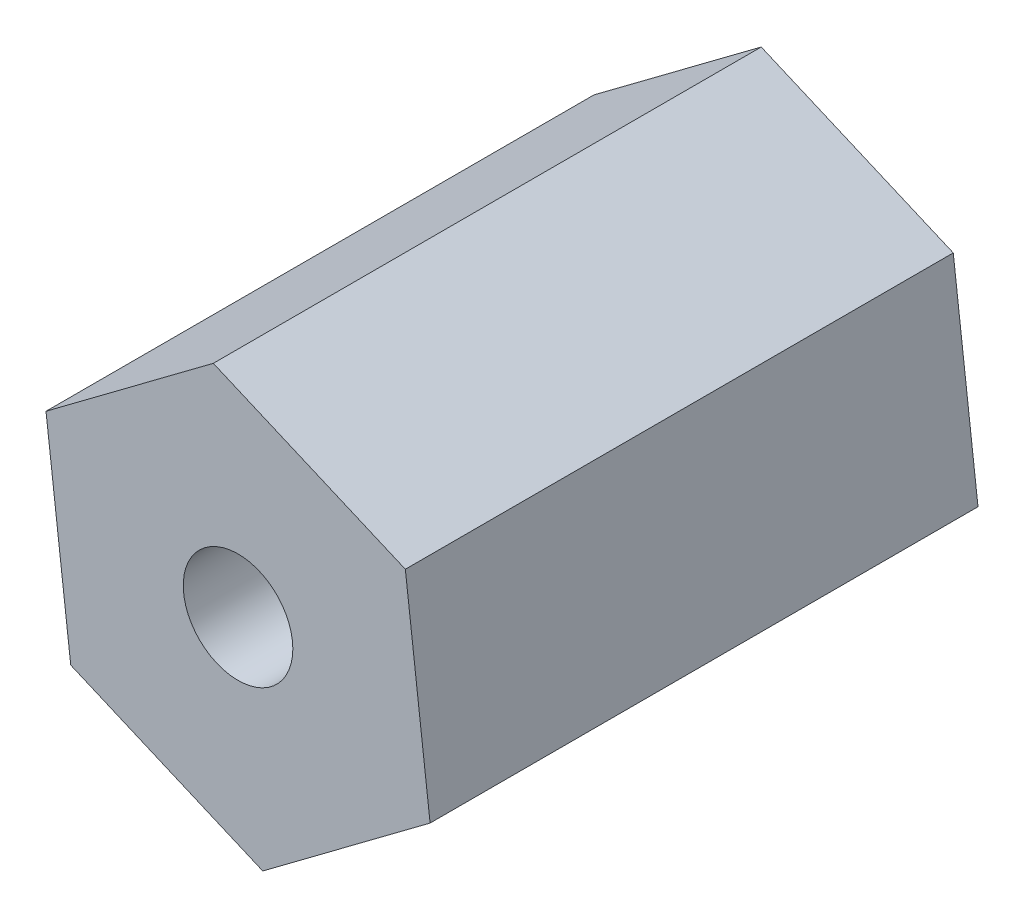
ISO-10303-21;
HEADER;
FILE_DESCRIPTION(('STEP AP214'),'2;1');
FILE_NAME('part.step','',(''),(''),'','','');
FILE_SCHEMA(('AUTOMOTIVE_DESIGN { 1 0 10303 214 1 1 1 1 }'));
ENDSEC;
DATA;
#1=APPLICATION_CONTEXT('core data for automotive mechanical design processes');
#2=APPLICATION_PROTOCOL_DEFINITION('international standard','automotive_design',2000,#1);
#3=PRODUCT_CONTEXT('',#1,'mechanical');
#4=PRODUCT('Part','Part','',(#3));
#5=PRODUCT_RELATED_PRODUCT_CATEGORY('part','',(#4));
#6=PRODUCT_DEFINITION_FORMATION('','',#4);
#7=PRODUCT_DEFINITION_CONTEXT('part definition',#1,'design');
#8=PRODUCT_DEFINITION('design','',#6,#7);
#9=PRODUCT_DEFINITION_SHAPE('','',#8);
#10=(LENGTH_UNIT() NAMED_UNIT(*) SI_UNIT(.MILLI.,.METRE.));
#11=(NAMED_UNIT(*) PLANE_ANGLE_UNIT() SI_UNIT($,.RADIAN.));
#12=(NAMED_UNIT(*) SI_UNIT($,.STERADIAN.) SOLID_ANGLE_UNIT());
#13=UNCERTAINTY_MEASURE_WITH_UNIT(LENGTH_MEASURE(1.E-05),#10,'distance_accuracy_value','');
#14=(GEOMETRIC_REPRESENTATION_CONTEXT(3) GLOBAL_UNCERTAINTY_ASSIGNED_CONTEXT((#13)) GLOBAL_UNIT_ASSIGNED_CONTEXT((#10,
#11,#12)) REPRESENTATION_CONTEXT('',''));
#15=CARTESIAN_POINT('',(0.,0.,0.));
#16=DIRECTION('',(0.,0.,1.));
#17=DIRECTION('',(1.,0.,0.));
#18=AXIS2_PLACEMENT_3D('',#15,#16,#17);
#19=CARTESIAN_POINT('',(-76.3813969155034,4.71352086722475,9.525));
#20=DIRECTION('',(0.,0.,1.));
#21=DIRECTION('',(1.,0.,0.));
#22=AXIS2_PLACEMENT_3D('',#19,#20,#21);
#23=PLANE('',#22);
#24=DIRECTION('',(0.800716634619522,0.599043296468283,0.));
#25=VECTOR('',#24,1.);
#26=CARTESIAN_POINT('',(-79.2897598757684,2.53767580579264,9.525));
#27=LINE('',#26,#25);
#28=CARTESIAN_POINT('',(-79.2897598757684,2.53767580579264,9.525));
#29=VERTEX_POINT('',#28);
#30=CARTESIAN_POINT('',(-76.3813969155034,4.71352086722476,9.525));
#31=VERTEX_POINT('',#30);
#32=EDGE_CURVE('E130',#29,#31,#27,.T.);
#33=ORIENTED_EDGE('',*,*,#32,.T.);
#34=DIRECTION('',(-0.118428395398548,0.99296259504743,0.));
#35=VECTOR('',#34,1.);
#36=CARTESIAN_POINT('',(-76.3813969155034,4.71352086722476,9.525));
#37=LINE('',#36,#35);
#38=CARTESIAN_POINT('',(-76.81155253327,8.32015960495602,9.525));
#39=VERTEX_POINT('',#38);
#40=EDGE_CURVE('E88',#31,#39,#37,.T.);
#41=ORIENTED_EDGE('',*,*,#40,.T.);
#42=DIRECTION('',(-0.919145030018068,0.393919298579144,0.));
#43=VECTOR('',#42,1.);
#44=CARTESIAN_POINT('',(-76.81155253327,8.32015960495602,9.525));
#45=LINE('',#44,#43);
#46=CARTESIAN_POINT('',(-80.1500711113016,9.75095328125519,9.525));
#47=VERTEX_POINT('',#46);
#48=EDGE_CURVE('E101',#39,#47,#45,.T.);
#49=ORIENTED_EDGE('',*,*,#48,.T.);
#50=DIRECTION('',(-0.80071663461952,-0.599043296468285,0.));
#51=VECTOR('',#50,1.);
#52=CARTESIAN_POINT('',(-80.1500711113016,9.75095328125519,9.525));
#53=LINE('',#52,#51);
#54=CARTESIAN_POINT('',(-83.0584340715666,7.57510821982309,9.525));
#55=VERTEX_POINT('',#54);
#56=EDGE_CURVE('E95',#47,#55,#53,.T.);
#57=ORIENTED_EDGE('',*,*,#56,.T.);
#58=DIRECTION('',(0.118428395398547,-0.992962595047429,0.));
#59=VECTOR('',#58,1.);
#60=CARTESIAN_POINT('',(-83.0584340715666,7.57510821982309,9.525));
#61=LINE('',#60,#59);
#62=CARTESIAN_POINT('',(-82.6282784538,3.96846948209181,9.525));
#63=VERTEX_POINT('',#62);
#64=EDGE_CURVE('E99',#55,#63,#61,.T.);
#65=ORIENTED_EDGE('',*,*,#64,.T.);
#66=DIRECTION('',(0.919145030018067,-0.393919298579145,0.));
#67=VECTOR('',#66,1.);
#68=CARTESIAN_POINT('',(-82.6282784538,3.96846948209181,9.525));
#69=LINE('',#68,#67);
#70=EDGE_CURVE('E51',#63,#29,#69,.T.);
#71=ORIENTED_EDGE('',*,*,#70,.T.);
#72=EDGE_LOOP('',(#33,#41,#49,#57,#65,#71));
#73=FACE_BOUND('',#72,.T.);
#74=CARTESIAN_POINT('',(-79.719915493535,6.14431454352392,9.525));
#75=DIRECTION('',(0.,0.,1.));
#76=DIRECTION('',(1.,0.,0.));
#77=AXIS2_PLACEMENT_3D('',#74,#75,#76);
#78=CIRCLE('',#77,0.952499999999996);
#79=CARTESIAN_POINT('',(-78.767415493535,6.14431454352392,9.525));
#80=VERTEX_POINT('',#79);
#81=EDGE_CURVE('E123',#80,#80,#78,.T.);
#82=ORIENTED_EDGE('',*,*,#81,.F.);
#83=EDGE_LOOP('',(#82));
#84=FACE_BOUND('',#83,.T.);
#85=ADVANCED_FACE('F34',(#73,#84),#23,.T.);
#86=CARTESIAN_POINT('',(-76.3813969155034,4.71352086722475,0.));
#87=DIRECTION('',(0.,0.,1.));
#88=DIRECTION('',(1.,0.,0.));
#89=AXIS2_PLACEMENT_3D('',#86,#87,#88);
#90=PLANE('',#89);
#91=DIRECTION('',(0.800716634619522,0.599043296468283,0.));
#92=VECTOR('',#91,1.);
#93=CARTESIAN_POINT('',(-79.2897598757684,2.53767580579264,0.));
#94=LINE('',#93,#92);
#95=CARTESIAN_POINT('',(-79.2897598757684,2.53767580579264,0.));
#96=VERTEX_POINT('',#95);
#97=CARTESIAN_POINT('',(-76.3813969155034,4.71352086722476,0.));
#98=VERTEX_POINT('',#97);
#99=EDGE_CURVE('E119',#96,#98,#94,.T.);
#100=ORIENTED_EDGE('',*,*,#99,.F.);
#101=DIRECTION('',(0.919145030018067,-0.393919298579145,0.));
#102=VECTOR('',#101,1.);
#103=CARTESIAN_POINT('',(-82.6282784538,3.96846948209181,0.));
#104=LINE('',#103,#102);
#105=CARTESIAN_POINT('',(-82.6282784538,3.96846948209181,0.));
#106=VERTEX_POINT('',#105);
#107=EDGE_CURVE('E80',#106,#96,#104,.T.);
#108=ORIENTED_EDGE('',*,*,#107,.F.);
#109=DIRECTION('',(0.118428395398547,-0.992962595047429,0.));
#110=VECTOR('',#109,1.);
#111=CARTESIAN_POINT('',(-83.0584340715666,7.57510821982309,0.));
#112=LINE('',#111,#110);
#113=CARTESIAN_POINT('',(-83.0584340715666,7.57510821982309,0.));
#114=VERTEX_POINT('',#113);
#115=EDGE_CURVE('E74',#114,#106,#112,.T.);
#116=ORIENTED_EDGE('',*,*,#115,.F.);
#117=DIRECTION('',(-0.80071663461952,-0.599043296468285,0.));
#118=VECTOR('',#117,1.);
#119=CARTESIAN_POINT('',(-80.1500711113016,9.75095328125519,0.));
#120=LINE('',#119,#118);
#121=CARTESIAN_POINT('',(-80.1500711113016,9.75095328125519,0.));
#122=VERTEX_POINT('',#121);
#123=EDGE_CURVE('E109',#122,#114,#120,.T.);
#124=ORIENTED_EDGE('',*,*,#123,.F.);
#125=DIRECTION('',(-0.919145030018068,0.393919298579144,0.));
#126=VECTOR('',#125,1.);
#127=CARTESIAN_POINT('',(-76.81155253327,8.32015960495602,0.));
#128=LINE('',#127,#126);
#129=CARTESIAN_POINT('',(-76.81155253327,8.32015960495602,0.));
#130=VERTEX_POINT('',#129);
#131=EDGE_CURVE('E125',#130,#122,#128,.T.);
#132=ORIENTED_EDGE('',*,*,#131,.F.);
#133=DIRECTION('',(-0.118428395398548,0.99296259504743,0.));
#134=VECTOR('',#133,1.);
#135=CARTESIAN_POINT('',(-76.3813969155034,4.71352086722476,0.));
#136=LINE('',#135,#134);
#137=EDGE_CURVE('E122',#98,#130,#136,.T.);
#138=ORIENTED_EDGE('',*,*,#137,.F.);
#139=EDGE_LOOP('',(#100,#108,#116,#124,#132,#138));
#140=FACE_BOUND('',#139,.T.);
#141=CARTESIAN_POINT('',(-79.719915493535,6.14431454352392,0.));
#142=DIRECTION('',(0.,0.,1.));
#143=DIRECTION('',(1.,0.,0.));
#144=AXIS2_PLACEMENT_3D('',#141,#142,#143);
#145=CIRCLE('',#144,0.952499999999996);
#146=CARTESIAN_POINT('',(-78.767415493535,6.14431454352392,0.));
#147=VERTEX_POINT('',#146);
#148=EDGE_CURVE('E223',#147,#147,#145,.T.);
#149=ORIENTED_EDGE('',*,*,#148,.T.);
#150=EDGE_LOOP('',(#149));
#151=FACE_BOUND('',#150,.T.);
#152=ADVANCED_FACE('F139',(#140,#151),#90,.F.);
#153=CARTESIAN_POINT('',(-79.2897598757684,2.53767580579264,9.525));
#154=DIRECTION('',(-0.599043296468283,0.800716634619522,0.));
#155=DIRECTION('',(-0.800716634619522,-0.599043296468283,0.));
#156=AXIS2_PLACEMENT_3D('',#153,#154,#155);
#157=PLANE('',#156);
#158=ORIENTED_EDGE('',*,*,#99,.T.);
#159=DIRECTION('',(0.,0.,-1.));
#160=VECTOR('',#159,1.);
#161=CARTESIAN_POINT('',(-76.3813969155034,4.71352086722476,9.525));
#162=LINE('',#161,#160);
#163=EDGE_CURVE('E11',#31,#98,#162,.T.);
#164=ORIENTED_EDGE('',*,*,#163,.F.);
#165=ORIENTED_EDGE('',*,*,#32,.F.);
#166=DIRECTION('',(0.,0.,-1.));
#167=VECTOR('',#166,1.);
#168=CARTESIAN_POINT('',(-79.2897598757684,2.53767580579264,9.525));
#169=LINE('',#168,#167);
#170=EDGE_CURVE('E115',#29,#96,#169,.T.);
#171=ORIENTED_EDGE('',*,*,#170,.T.);
#172=EDGE_LOOP('',(#158,#164,#165,#171));
#173=FACE_BOUND('',#172,.T.);
#174=ADVANCED_FACE('F36',(#173),#157,.F.);
#175=CARTESIAN_POINT('',(-76.3813969155034,4.71352086722476,9.525));
#176=DIRECTION('',(-0.992962595047429,-0.118428395398548,0.));
#177=DIRECTION('',(0.118428395398548,-0.992962595047429,0.));
#178=AXIS2_PLACEMENT_3D('',#175,#176,#177);
#179=PLANE('',#178);
#180=ORIENTED_EDGE('',*,*,#137,.T.);
#181=DIRECTION('',(0.,0.,-1.));
#182=VECTOR('',#181,1.);
#183=CARTESIAN_POINT('',(-76.81155253327,8.32015960495602,9.525));
#184=LINE('',#183,#182);
#185=EDGE_CURVE('E43',#39,#130,#184,.T.);
#186=ORIENTED_EDGE('',*,*,#185,.F.);
#187=ORIENTED_EDGE('',*,*,#40,.F.);
#188=ORIENTED_EDGE('',*,*,#163,.T.);
#189=EDGE_LOOP('',(#180,#186,#187,#188));
#190=FACE_BOUND('',#189,.T.);
#191=ADVANCED_FACE('F164',(#190),#179,.F.);
#192=CARTESIAN_POINT('',(-76.81155253327,8.32015960495602,9.525));
#193=DIRECTION('',(-0.393919298579144,-0.919145030018068,0.));
#194=DIRECTION('',(0.919145030018068,-0.393919298579144,0.));
#195=AXIS2_PLACEMENT_3D('',#192,#193,#194);
#196=PLANE('',#195);
#197=ORIENTED_EDGE('',*,*,#131,.T.);
#198=DIRECTION('',(0.,0.,-1.));
#199=VECTOR('',#198,1.);
#200=CARTESIAN_POINT('',(-80.1500711113016,9.75095328125519,9.525));
#201=LINE('',#200,#199);
#202=EDGE_CURVE('E110',#47,#122,#201,.T.);
#203=ORIENTED_EDGE('',*,*,#202,.F.);
#204=ORIENTED_EDGE('',*,*,#48,.F.);
#205=ORIENTED_EDGE('',*,*,#185,.T.);
#206=EDGE_LOOP('',(#197,#203,#204,#205));
#207=FACE_BOUND('',#206,.T.);
#208=ADVANCED_FACE('F136',(#207),#196,.F.);
#209=CARTESIAN_POINT('',(-80.1500711113016,9.75095328125519,9.525));
#210=DIRECTION('',(0.599043296468285,-0.80071663461952,0.));
#211=DIRECTION('',(0.80071663461952,0.599043296468285,0.));
#212=AXIS2_PLACEMENT_3D('',#209,#210,#211);
#213=PLANE('',#212);
#214=ORIENTED_EDGE('',*,*,#123,.T.);
#215=DIRECTION('',(0.,0.,-1.));
#216=VECTOR('',#215,1.);
#217=CARTESIAN_POINT('',(-83.0584340715666,7.57510821982309,9.525));
#218=LINE('',#217,#216);
#219=EDGE_CURVE('E106',#55,#114,#218,.T.);
#220=ORIENTED_EDGE('',*,*,#219,.F.);
#221=ORIENTED_EDGE('',*,*,#56,.F.);
#222=ORIENTED_EDGE('',*,*,#202,.T.);
#223=EDGE_LOOP('',(#214,#220,#221,#222));
#224=FACE_BOUND('',#223,.T.);
#225=ADVANCED_FACE('F107',(#224),#213,.F.);
#226=CARTESIAN_POINT('',(-83.0584340715666,7.57510821982309,9.525));
#227=DIRECTION('',(0.99296259504743,0.118428395398547,0.));
#228=DIRECTION('',(-0.118428395398547,0.992962595047429,0.));
#229=AXIS2_PLACEMENT_3D('',#226,#227,#228);
#230=PLANE('',#229);
#231=ORIENTED_EDGE('',*,*,#115,.T.);
#232=DIRECTION('',(0.,0.,-1.));
#233=VECTOR('',#232,1.);
#234=CARTESIAN_POINT('',(-82.6282784538,3.96846948209181,9.525));
#235=LINE('',#234,#233);
#236=EDGE_CURVE('E111',#63,#106,#235,.T.);
#237=ORIENTED_EDGE('',*,*,#236,.F.);
#238=ORIENTED_EDGE('',*,*,#64,.F.);
#239=ORIENTED_EDGE('',*,*,#219,.T.);
#240=EDGE_LOOP('',(#231,#237,#238,#239));
#241=FACE_BOUND('',#240,.T.);
#242=ADVANCED_FACE('F113',(#241),#230,.F.);
#243=CARTESIAN_POINT('',(-82.6282784538,3.96846948209181,9.525));
#244=DIRECTION('',(0.393919298579145,0.919145030018067,0.));
#245=DIRECTION('',(-0.919145030018068,0.393919298579145,0.));
#246=AXIS2_PLACEMENT_3D('',#243,#244,#245);
#247=PLANE('',#246);
#248=ORIENTED_EDGE('',*,*,#107,.T.);
#249=ORIENTED_EDGE('',*,*,#170,.F.);
#250=ORIENTED_EDGE('',*,*,#70,.F.);
#251=ORIENTED_EDGE('',*,*,#236,.T.);
#252=EDGE_LOOP('',(#248,#249,#250,#251));
#253=FACE_BOUND('',#252,.T.);
#254=ADVANCED_FACE('F144',(#253),#247,.F.);
#255=CARTESIAN_POINT('',(-79.719915493535,6.14431454352392,9.525));
#256=DIRECTION('',(0.,0.,-1.));
#257=DIRECTION('',(-1.,0.,0.));
#258=AXIS2_PLACEMENT_3D('',#255,#256,#257);
#259=CYLINDRICAL_SURFACE('',#258,0.952499999999996);
#260=ORIENTED_EDGE('',*,*,#81,.T.);
#261=EDGE_LOOP('',(#260));
#262=FACE_BOUND('',#261,.T.);
#263=ORIENTED_EDGE('',*,*,#148,.F.);
#264=EDGE_LOOP('',(#263));
#265=FACE_BOUND('',#264,.T.);
#266=ADVANCED_FACE('F146',(#262,#265),#259,.F.);
#267=CLOSED_SHELL('',(#85,#152,#174,#191,#208,#225,#242,#254,#266));
#268=MANIFOLD_SOLID_BREP('B2',#267);
#269=ADVANCED_BREP_SHAPE_REPRESENTATION('',(#18,#268),#14);
#270=SHAPE_DEFINITION_REPRESENTATION(#9,#269);
ENDSEC;
END-ISO-10303-21;
